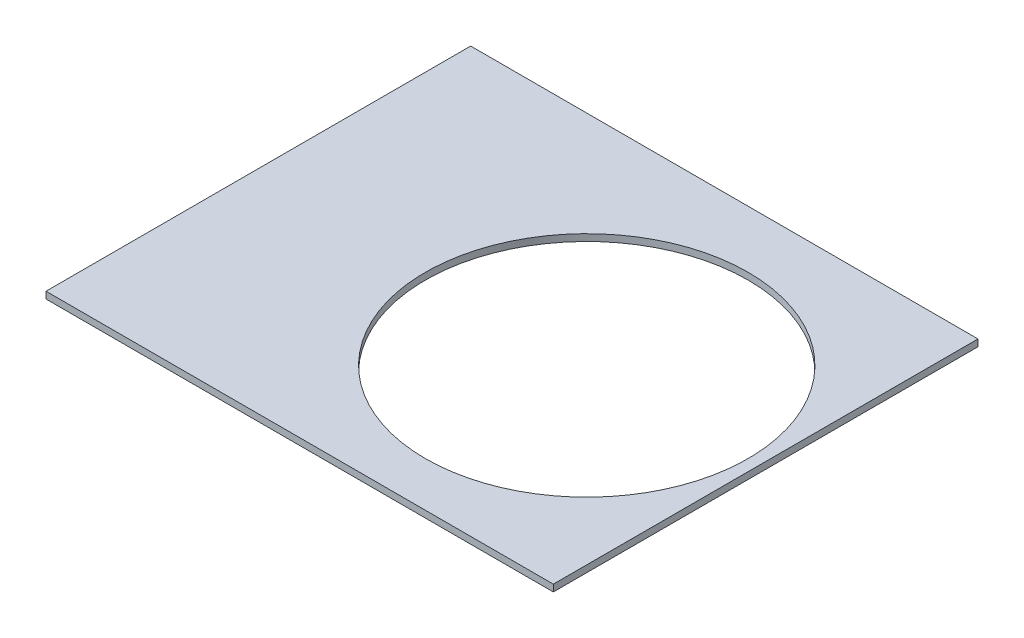
ISO-10303-21;
HEADER;
FILE_DESCRIPTION(('STEP AP214'),'2;1');
FILE_NAME('part.step','',(''),(''),'','','');
FILE_SCHEMA(('AUTOMOTIVE_DESIGN { 1 0 10303 214 1 1 1 1 }'));
ENDSEC;
DATA;
#1=APPLICATION_CONTEXT('core data for automotive mechanical design processes');
#2=APPLICATION_PROTOCOL_DEFINITION('international standard','automotive_design',2000,#1);
#3=PRODUCT_CONTEXT('',#1,'mechanical');
#4=PRODUCT('Part','Part','',(#3));
#5=PRODUCT_RELATED_PRODUCT_CATEGORY('part','',(#4));
#6=PRODUCT_DEFINITION_FORMATION('','',#4);
#7=PRODUCT_DEFINITION_CONTEXT('part definition',#1,'design');
#8=PRODUCT_DEFINITION('design','',#6,#7);
#9=PRODUCT_DEFINITION_SHAPE('','',#8);
#10=(LENGTH_UNIT() NAMED_UNIT(*) SI_UNIT(.MILLI.,.METRE.));
#11=(NAMED_UNIT(*) PLANE_ANGLE_UNIT() SI_UNIT($,.RADIAN.));
#12=(NAMED_UNIT(*) SI_UNIT($,.STERADIAN.) SOLID_ANGLE_UNIT());
#13=UNCERTAINTY_MEASURE_WITH_UNIT(LENGTH_MEASURE(1.E-05),#10,'distance_accuracy_value','');
#14=(GEOMETRIC_REPRESENTATION_CONTEXT(3) GLOBAL_UNCERTAINTY_ASSIGNED_CONTEXT((#13)) GLOBAL_UNIT_ASSIGNED_CONTEXT((#10,
#11,#12)) REPRESENTATION_CONTEXT('',''));
#15=CARTESIAN_POINT('',(0.,0.,0.));
#16=DIRECTION('',(0.,0.,1.));
#17=DIRECTION('',(1.,0.,0.));
#18=AXIS2_PLACEMENT_3D('',#15,#16,#17);
#19=CARTESIAN_POINT('',(-44.8,1.2,37.5));
#20=DIRECTION('',(1.,0.,0.));
#21=DIRECTION('',(0.,0.,-1.));
#22=AXIS2_PLACEMENT_3D('',#19,#20,#21);
#23=PLANE('',#22);
#24=DIRECTION('',(0.,0.,1.));
#25=VECTOR('',#24,1.);
#26=CARTESIAN_POINT('',(-44.8,0.,37.5));
#27=LINE('',#26,#25);
#28=CARTESIAN_POINT('',(-44.8,0.,-37.5));
#29=VERTEX_POINT('',#28);
#30=CARTESIAN_POINT('',(-44.8,0.,37.5));
#31=VERTEX_POINT('',#30);
#32=EDGE_CURVE('E97',#29,#31,#27,.T.);
#33=ORIENTED_EDGE('',*,*,#32,.T.);
#34=DIRECTION('',(0.,-1.,0.));
#35=VECTOR('',#34,1.);
#36=CARTESIAN_POINT('',(-44.8,1.2,37.5));
#37=LINE('',#36,#35);
#38=CARTESIAN_POINT('',(-44.8,1.2,37.5));
#39=VERTEX_POINT('',#38);
#40=EDGE_CURVE('E11',#39,#31,#37,.T.);
#41=ORIENTED_EDGE('',*,*,#40,.F.);
#42=DIRECTION('',(0.,0.,1.));
#43=VECTOR('',#42,1.);
#44=CARTESIAN_POINT('',(-44.8,1.2,37.5));
#45=LINE('',#44,#43);
#46=CARTESIAN_POINT('',(-44.8,1.2,-37.5));
#47=VERTEX_POINT('',#46);
#48=EDGE_CURVE('E85',#47,#39,#45,.T.);
#49=ORIENTED_EDGE('',*,*,#48,.F.);
#50=DIRECTION('',(0.,-1.,0.));
#51=VECTOR('',#50,1.);
#52=CARTESIAN_POINT('',(-44.8,1.2,-37.5));
#53=LINE('',#52,#51);
#54=EDGE_CURVE('E93',#47,#29,#53,.T.);
#55=ORIENTED_EDGE('',*,*,#54,.T.);
#56=EDGE_LOOP('',(#33,#41,#49,#55));
#57=FACE_BOUND('',#56,.T.);
#58=ADVANCED_FACE('F34',(#57),#23,.F.);
#59=CARTESIAN_POINT('',(44.8,1.2,37.5));
#60=DIRECTION('',(0.,0.,-1.));
#61=DIRECTION('',(-1.,0.,0.));
#62=AXIS2_PLACEMENT_3D('',#59,#60,#61);
#63=PLANE('',#62);
#64=DIRECTION('',(1.,0.,0.));
#65=VECTOR('',#64,1.);
#66=CARTESIAN_POINT('',(44.8,0.,37.5));
#67=LINE('',#66,#65);
#68=CARTESIAN_POINT('',(44.8,0.,37.5));
#69=VERTEX_POINT('',#68);
#70=EDGE_CURVE('E89',#31,#69,#67,.T.);
#71=ORIENTED_EDGE('',*,*,#70,.T.);
#72=DIRECTION('',(0.,-1.,0.));
#73=VECTOR('',#72,1.);
#74=CARTESIAN_POINT('',(44.8,1.2,37.5));
#75=LINE('',#74,#73);
#76=CARTESIAN_POINT('',(44.8,1.2,37.5));
#77=VERTEX_POINT('',#76);
#78=EDGE_CURVE('E42',#77,#69,#75,.T.);
#79=ORIENTED_EDGE('',*,*,#78,.F.);
#80=DIRECTION('',(1.,0.,0.));
#81=VECTOR('',#80,1.);
#82=CARTESIAN_POINT('',(44.8,1.2,37.5));
#83=LINE('',#82,#81);
#84=EDGE_CURVE('E80',#39,#77,#83,.T.);
#85=ORIENTED_EDGE('',*,*,#84,.F.);
#86=ORIENTED_EDGE('',*,*,#40,.T.);
#87=EDGE_LOOP('',(#71,#79,#85,#86));
#88=FACE_BOUND('',#87,.T.);
#89=ADVANCED_FACE('F88',(#88),#63,.F.);
#90=CARTESIAN_POINT('',(44.8,1.2,37.5));
#91=DIRECTION('',(-1.,0.,0.));
#92=DIRECTION('',(0.,0.,1.));
#93=AXIS2_PLACEMENT_3D('',#90,#91,#92);
#94=PLANE('',#93);
#95=DIRECTION('',(0.,0.,-1.));
#96=VECTOR('',#95,1.);
#97=CARTESIAN_POINT('',(44.8,0.,37.5));
#98=LINE('',#97,#96);
#99=CARTESIAN_POINT('',(44.8,0.,-37.5));
#100=VERTEX_POINT('',#99);
#101=EDGE_CURVE('E67',#69,#100,#98,.T.);
#102=ORIENTED_EDGE('',*,*,#101,.T.);
#103=DIRECTION('',(0.,-1.,0.));
#104=VECTOR('',#103,1.);
#105=CARTESIAN_POINT('',(44.8,1.2,-37.5));
#106=LINE('',#105,#104);
#107=CARTESIAN_POINT('',(44.8,1.2,-37.5));
#108=VERTEX_POINT('',#107);
#109=EDGE_CURVE('E90',#108,#100,#106,.T.);
#110=ORIENTED_EDGE('',*,*,#109,.F.);
#111=DIRECTION('',(0.,0.,-1.));
#112=VECTOR('',#111,1.);
#113=CARTESIAN_POINT('',(44.8,1.2,37.5));
#114=LINE('',#113,#112);
#115=EDGE_CURVE('E83',#77,#108,#114,.T.);
#116=ORIENTED_EDGE('',*,*,#115,.F.);
#117=ORIENTED_EDGE('',*,*,#78,.T.);
#118=EDGE_LOOP('',(#102,#110,#116,#117));
#119=FACE_BOUND('',#118,.T.);
#120=ADVANCED_FACE('F91',(#119),#94,.F.);
#121=CARTESIAN_POINT('',(44.8,1.2,-37.5));
#122=DIRECTION('',(0.,0.,1.));
#123=DIRECTION('',(1.,0.,0.));
#124=AXIS2_PLACEMENT_3D('',#121,#122,#123);
#125=PLANE('',#124);
#126=DIRECTION('',(-1.,0.,0.));
#127=VECTOR('',#126,1.);
#128=CARTESIAN_POINT('',(44.8,0.,-37.5));
#129=LINE('',#128,#127);
#130=EDGE_CURVE('E73',#100,#29,#129,.T.);
#131=ORIENTED_EDGE('',*,*,#130,.T.);
#132=ORIENTED_EDGE('',*,*,#54,.F.);
#133=DIRECTION('',(-1.,0.,0.));
#134=VECTOR('',#133,1.);
#135=CARTESIAN_POINT('',(44.8,1.2,-37.5));
#136=LINE('',#135,#134);
#137=EDGE_CURVE('E50',#108,#47,#136,.T.);
#138=ORIENTED_EDGE('',*,*,#137,.F.);
#139=ORIENTED_EDGE('',*,*,#109,.T.);
#140=EDGE_LOOP('',(#131,#132,#138,#139));
#141=FACE_BOUND('',#140,.T.);
#142=ADVANCED_FACE('F105',(#141),#125,.F.);
#143=CARTESIAN_POINT('',(0.,1.2,0.));
#144=DIRECTION('',(0.,1.,0.));
#145=DIRECTION('',(0.,0.,1.));
#146=AXIS2_PLACEMENT_3D('',#143,#144,#145);
#147=PLANE('',#146);
#148=CARTESIAN_POINT('',(14.3,1.2,1.1));
#149=DIRECTION('',(0.,1.,0.));
#150=DIRECTION('',(0.,0.,1.));
#151=AXIS2_PLACEMENT_3D('',#148,#149,#150);
#152=CIRCLE('',#151,28.5);
#153=CARTESIAN_POINT('',(14.3,1.2,29.6));
#154=VERTEX_POINT('',#153);
#155=EDGE_CURVE('E100',#154,#154,#152,.T.);
#156=ORIENTED_EDGE('',*,*,#155,.F.);
#157=EDGE_LOOP('',(#156));
#158=FACE_BOUND('',#157,.T.);
#159=ORIENTED_EDGE('',*,*,#48,.T.);
#160=ORIENTED_EDGE('',*,*,#84,.T.);
#161=ORIENTED_EDGE('',*,*,#115,.T.);
#162=ORIENTED_EDGE('',*,*,#137,.T.);
#163=EDGE_LOOP('',(#159,#160,#161,#162));
#164=FACE_BOUND('',#163,.T.);
#165=ADVANCED_FACE('F81',(#158,#164),#147,.T.);
#166=CARTESIAN_POINT('',(0.,0.,0.));
#167=DIRECTION('',(0.,1.,0.));
#168=DIRECTION('',(0.,0.,1.));
#169=AXIS2_PLACEMENT_3D('',#166,#167,#168);
#170=PLANE('',#169);
#171=CARTESIAN_POINT('',(14.3,0.,1.1));
#172=DIRECTION('',(0.,1.,0.));
#173=DIRECTION('',(0.,0.,1.));
#174=AXIS2_PLACEMENT_3D('',#171,#172,#173);
#175=CIRCLE('',#174,28.5);
#176=CARTESIAN_POINT('',(14.3,0.,29.6));
#177=VERTEX_POINT('',#176);
#178=EDGE_CURVE('E113',#177,#177,#175,.T.);
#179=ORIENTED_EDGE('',*,*,#178,.T.);
#180=EDGE_LOOP('',(#179));
#181=FACE_BOUND('',#180,.T.);
#182=ORIENTED_EDGE('',*,*,#32,.F.);
#183=ORIENTED_EDGE('',*,*,#130,.F.);
#184=ORIENTED_EDGE('',*,*,#101,.F.);
#185=ORIENTED_EDGE('',*,*,#70,.F.);
#186=EDGE_LOOP('',(#182,#183,#184,#185));
#187=FACE_BOUND('',#186,.T.);
#188=ADVANCED_FACE('F108',(#181,#187),#170,.F.);
#189=CARTESIAN_POINT('',(14.3,0.,1.1));
#190=DIRECTION('',(0.,1.,0.));
#191=DIRECTION('',(0.,0.,1.));
#192=AXIS2_PLACEMENT_3D('',#189,#190,#191);
#193=CYLINDRICAL_SURFACE('',#192,28.5);
#194=ORIENTED_EDGE('',*,*,#155,.T.);
#195=EDGE_LOOP('',(#194));
#196=FACE_BOUND('',#195,.T.);
#197=ORIENTED_EDGE('',*,*,#178,.F.);
#198=EDGE_LOOP('',(#197));
#199=FACE_BOUND('',#198,.T.);
#200=ADVANCED_FACE('F118',(#196,#199),#193,.F.);
#201=CLOSED_SHELL('',(#58,#89,#120,#142,#165,#188,#200));
#202=MANIFOLD_SOLID_BREP('B2',#201);
#203=ADVANCED_BREP_SHAPE_REPRESENTATION('',(#18,#202),#14);
#204=SHAPE_DEFINITION_REPRESENTATION(#9,#203);
ENDSEC;
END-ISO-10303-21;
